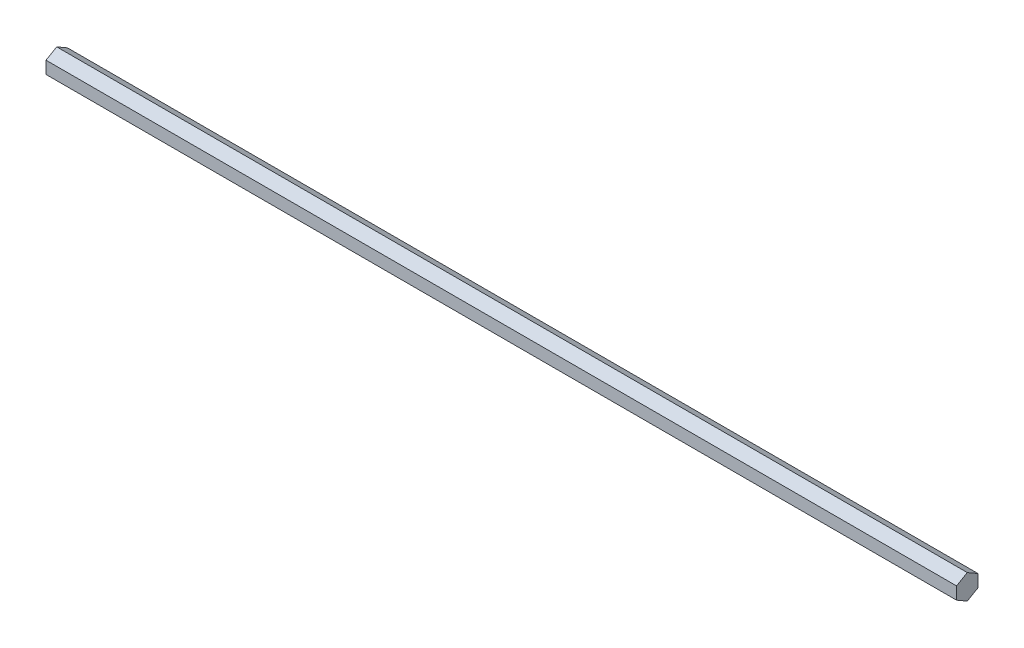
ISO-10303-21;
HEADER;
FILE_DESCRIPTION(('STEP AP214'),'2;1');
FILE_NAME('part.step','',(''),(''),'','','');
FILE_SCHEMA(('AUTOMOTIVE_DESIGN { 1 0 10303 214 1 1 1 1 }'));
ENDSEC;
DATA;
#1=APPLICATION_CONTEXT('core data for automotive mechanical design processes');
#2=APPLICATION_PROTOCOL_DEFINITION('international standard','automotive_design',2000,#1);
#3=PRODUCT_CONTEXT('',#1,'mechanical');
#4=PRODUCT('Part','Part','',(#3));
#5=PRODUCT_RELATED_PRODUCT_CATEGORY('part','',(#4));
#6=PRODUCT_DEFINITION_FORMATION('','',#4);
#7=PRODUCT_DEFINITION_CONTEXT('part definition',#1,'design');
#8=PRODUCT_DEFINITION('design','',#6,#7);
#9=PRODUCT_DEFINITION_SHAPE('','',#8);
#10=(LENGTH_UNIT() NAMED_UNIT(*) SI_UNIT(.MILLI.,.METRE.));
#11=(NAMED_UNIT(*) PLANE_ANGLE_UNIT() SI_UNIT($,.RADIAN.));
#12=(NAMED_UNIT(*) SI_UNIT($,.STERADIAN.) SOLID_ANGLE_UNIT());
#13=UNCERTAINTY_MEASURE_WITH_UNIT(LENGTH_MEASURE(1.E-05),#10,'distance_accuracy_value','');
#14=(GEOMETRIC_REPRESENTATION_CONTEXT(3) GLOBAL_UNCERTAINTY_ASSIGNED_CONTEXT((#13)) GLOBAL_UNIT_ASSIGNED_CONTEXT((#10,
#11,#12)) REPRESENTATION_CONTEXT('',''));
#15=CARTESIAN_POINT('',(0.,0.,0.));
#16=DIRECTION('',(0.,0.,1.));
#17=DIRECTION('',(1.,0.,0.));
#18=AXIS2_PLACEMENT_3D('',#15,#16,#17);
#19=CARTESIAN_POINT('',(539.75,3.6661742093542,-6.34999999999996));
#20=DIRECTION('',(0.,-0.866025403784442,0.499999999999995));
#21=DIRECTION('',(0.,-0.499999999999995,-0.866025403784442));
#22=AXIS2_PLACEMENT_3D('',#19,#20,#21);
#23=PLANE('',#22);
#24=DIRECTION('',(0.,0.499999999999995,0.866025403784442));
#25=VECTOR('',#24,1.);
#26=CARTESIAN_POINT('',(0.,3.6661742093542,-6.34999999999996));
#27=LINE('',#26,#25);
#28=CARTESIAN_POINT('',(0.,3.6661742093542,-6.34999999999996));
#29=VERTEX_POINT('',#28);
#30=CARTESIAN_POINT('',(0.,7.33234841870825,0.));
#31=VERTEX_POINT('',#30);
#32=EDGE_CURVE('E132',#29,#31,#27,.T.);
#33=ORIENTED_EDGE('',*,*,#32,.T.);
#34=DIRECTION('',(-1.,0.,0.));
#35=VECTOR('',#34,1.);
#36=CARTESIAN_POINT('',(539.75,7.33234841870825,0.));
#37=LINE('',#36,#35);
#38=CARTESIAN_POINT('',(539.75,7.33234841870825,0.));
#39=VERTEX_POINT('',#38);
#40=EDGE_CURVE('E11',#39,#31,#37,.T.);
#41=ORIENTED_EDGE('',*,*,#40,.F.);
#42=DIRECTION('',(0.,0.499999999999995,0.866025403784442));
#43=VECTOR('',#42,1.);
#44=CARTESIAN_POINT('',(539.75,3.6661742093542,-6.34999999999996));
#45=LINE('',#44,#43);
#46=CARTESIAN_POINT('',(539.75,3.6661742093542,-6.34999999999996));
#47=VERTEX_POINT('',#46);
#48=EDGE_CURVE('E142',#47,#39,#45,.T.);
#49=ORIENTED_EDGE('',*,*,#48,.F.);
#50=DIRECTION('',(-1.,0.,0.));
#51=VECTOR('',#50,1.);
#52=CARTESIAN_POINT('',(539.75,3.6661742093542,-6.34999999999996));
#53=LINE('',#52,#51);
#54=EDGE_CURVE('E128',#47,#29,#53,.T.);
#55=ORIENTED_EDGE('',*,*,#54,.T.);
#56=EDGE_LOOP('',(#33,#41,#49,#55));
#57=FACE_BOUND('',#56,.T.);
#58=ADVANCED_FACE('F37',(#57),#23,.F.);
#59=CARTESIAN_POINT('',(539.75,7.33234841870825,0.));
#60=DIRECTION('',(0.,-0.866025403784438,-0.500000000000001));
#61=DIRECTION('',(0.,0.500000000000001,-0.866025403784438));
#62=AXIS2_PLACEMENT_3D('',#59,#60,#61);
#63=PLANE('',#62);
#64=DIRECTION('',(0.,-0.500000000000001,0.866025403784438));
#65=VECTOR('',#64,1.);
#66=CARTESIAN_POINT('',(0.,7.33234841870825,0.));
#67=LINE('',#66,#65);
#68=CARTESIAN_POINT('',(0.,3.66617420935411,6.35000000000001));
#69=VERTEX_POINT('',#68);
#70=EDGE_CURVE('E135',#31,#69,#67,.T.);
#71=ORIENTED_EDGE('',*,*,#70,.T.);
#72=DIRECTION('',(-1.,0.,0.));
#73=VECTOR('',#72,1.);
#74=CARTESIAN_POINT('',(539.75,3.66617420935411,6.35000000000001));
#75=LINE('',#74,#73);
#76=CARTESIAN_POINT('',(539.75,3.66617420935411,6.35000000000001));
#77=VERTEX_POINT('',#76);
#78=EDGE_CURVE('E46',#77,#69,#75,.T.);
#79=ORIENTED_EDGE('',*,*,#78,.F.);
#80=DIRECTION('',(0.,-0.500000000000001,0.866025403784438));
#81=VECTOR('',#80,1.);
#82=CARTESIAN_POINT('',(539.75,7.33234841870825,0.));
#83=LINE('',#82,#81);
#84=EDGE_CURVE('E96',#39,#77,#83,.T.);
#85=ORIENTED_EDGE('',*,*,#84,.F.);
#86=ORIENTED_EDGE('',*,*,#40,.T.);
#87=EDGE_LOOP('',(#71,#79,#85,#86));
#88=FACE_BOUND('',#87,.T.);
#89=ADVANCED_FACE('F172',(#88),#63,.F.);
#90=CARTESIAN_POINT('',(539.75,3.66617420935411,6.35000000000001));
#91=DIRECTION('',(0.,0.,-1.));
#92=DIRECTION('',(0.,1.,0.));
#93=AXIS2_PLACEMENT_3D('',#90,#91,#92);
#94=PLANE('',#93);
#95=DIRECTION('',(0.,-1.,0.));
#96=VECTOR('',#95,1.);
#97=CARTESIAN_POINT('',(0.,3.66617420935411,6.35000000000001));
#98=LINE('',#97,#96);
#99=CARTESIAN_POINT('',(0.,-3.66617420935416,6.34999999999999));
#100=VERTEX_POINT('',#99);
#101=EDGE_CURVE('E137',#69,#100,#98,.T.);
#102=ORIENTED_EDGE('',*,*,#101,.T.);
#103=DIRECTION('',(-1.,0.,0.));
#104=VECTOR('',#103,1.);
#105=CARTESIAN_POINT('',(539.75,-3.66617420935416,6.34999999999999));
#106=LINE('',#105,#104);
#107=CARTESIAN_POINT('',(539.75,-3.66617420935416,6.34999999999999));
#108=VERTEX_POINT('',#107);
#109=EDGE_CURVE('E121',#108,#100,#106,.T.);
#110=ORIENTED_EDGE('',*,*,#109,.F.);
#111=DIRECTION('',(0.,-1.,0.));
#112=VECTOR('',#111,1.);
#113=CARTESIAN_POINT('',(539.75,3.66617420935411,6.35000000000001));
#114=LINE('',#113,#112);
#115=EDGE_CURVE('E110',#77,#108,#114,.T.);
#116=ORIENTED_EDGE('',*,*,#115,.F.);
#117=ORIENTED_EDGE('',*,*,#78,.T.);
#118=EDGE_LOOP('',(#102,#110,#116,#117));
#119=FACE_BOUND('',#118,.T.);
#120=ADVANCED_FACE('F154',(#119),#94,.F.);
#121=CARTESIAN_POINT('',(539.75,-3.66617420935416,6.34999999999999));
#122=DIRECTION('',(0.,0.866025403784442,-0.499999999999995));
#123=DIRECTION('',(0.,0.499999999999995,0.866025403784442));
#124=AXIS2_PLACEMENT_3D('',#121,#122,#123);
#125=PLANE('',#124);
#126=DIRECTION('',(0.,-0.499999999999995,-0.866025403784442));
#127=VECTOR('',#126,1.);
#128=CARTESIAN_POINT('',(0.,-3.66617420935416,6.34999999999999));
#129=LINE('',#128,#127);
#130=CARTESIAN_POINT('',(0.,-7.33234841870825,0.));
#131=VERTEX_POINT('',#130);
#132=EDGE_CURVE('E119',#100,#131,#129,.T.);
#133=ORIENTED_EDGE('',*,*,#132,.T.);
#134=DIRECTION('',(-1.,0.,0.));
#135=VECTOR('',#134,1.);
#136=CARTESIAN_POINT('',(539.75,-7.33234841870825,0.));
#137=LINE('',#136,#135);
#138=CARTESIAN_POINT('',(539.75,-7.33234841870825,0.));
#139=VERTEX_POINT('',#138);
#140=EDGE_CURVE('E116',#139,#131,#137,.T.);
#141=ORIENTED_EDGE('',*,*,#140,.F.);
#142=DIRECTION('',(0.,-0.499999999999995,-0.866025403784442));
#143=VECTOR('',#142,1.);
#144=CARTESIAN_POINT('',(539.75,-3.66617420935416,6.34999999999999));
#145=LINE('',#144,#143);
#146=EDGE_CURVE('E104',#108,#139,#145,.T.);
#147=ORIENTED_EDGE('',*,*,#146,.F.);
#148=ORIENTED_EDGE('',*,*,#109,.T.);
#149=EDGE_LOOP('',(#133,#141,#147,#148));
#150=FACE_BOUND('',#149,.T.);
#151=ADVANCED_FACE('F117',(#150),#125,.F.);
#152=CARTESIAN_POINT('',(539.75,-7.33234841870825,0.));
#153=DIRECTION('',(0.,0.866025403784435,0.500000000000007));
#154=DIRECTION('',(0.,-0.500000000000007,0.866025403784435));
#155=AXIS2_PLACEMENT_3D('',#152,#153,#154);
#156=PLANE('',#155);
#157=DIRECTION('',(0.,0.500000000000007,-0.866025403784435));
#158=VECTOR('',#157,1.);
#159=CARTESIAN_POINT('',(0.,-7.33234841870825,0.));
#160=LINE('',#159,#158);
#161=CARTESIAN_POINT('',(0.,-3.66617420935407,-6.35000000000004));
#162=VERTEX_POINT('',#161);
#163=EDGE_CURVE('E81',#131,#162,#160,.T.);
#164=ORIENTED_EDGE('',*,*,#163,.T.);
#165=DIRECTION('',(-1.,0.,0.));
#166=VECTOR('',#165,1.);
#167=CARTESIAN_POINT('',(539.75,-3.66617420935407,-6.35000000000004));
#168=LINE('',#167,#166);
#169=CARTESIAN_POINT('',(539.75,-3.66617420935407,-6.35000000000004));
#170=VERTEX_POINT('',#169);
#171=EDGE_CURVE('E122',#170,#162,#168,.T.);
#172=ORIENTED_EDGE('',*,*,#171,.F.);
#173=DIRECTION('',(0.,0.500000000000007,-0.866025403784435));
#174=VECTOR('',#173,1.);
#175=CARTESIAN_POINT('',(539.75,-7.33234841870825,0.));
#176=LINE('',#175,#174);
#177=EDGE_CURVE('E108',#139,#170,#176,.T.);
#178=ORIENTED_EDGE('',*,*,#177,.F.);
#179=ORIENTED_EDGE('',*,*,#140,.T.);
#180=EDGE_LOOP('',(#164,#172,#178,#179));
#181=FACE_BOUND('',#180,.T.);
#182=ADVANCED_FACE('F124',(#181),#156,.F.);
#183=CARTESIAN_POINT('',(539.75,-3.66617420935407,-6.35000000000004));
#184=DIRECTION('',(0.,0.,1.));
#185=DIRECTION('',(0.,-1.,0.));
#186=AXIS2_PLACEMENT_3D('',#183,#184,#185);
#187=PLANE('',#186);
#188=DIRECTION('',(0.,1.,0.));
#189=VECTOR('',#188,1.);
#190=CARTESIAN_POINT('',(0.,-3.66617420935407,-6.35000000000004));
#191=LINE('',#190,#189);
#192=EDGE_CURVE('E87',#162,#29,#191,.T.);
#193=ORIENTED_EDGE('',*,*,#192,.T.);
#194=ORIENTED_EDGE('',*,*,#54,.F.);
#195=DIRECTION('',(0.,1.,0.));
#196=VECTOR('',#195,1.);
#197=CARTESIAN_POINT('',(539.75,-3.66617420935407,-6.35000000000004));
#198=LINE('',#197,#196);
#199=EDGE_CURVE('E57',#170,#47,#198,.T.);
#200=ORIENTED_EDGE('',*,*,#199,.F.);
#201=ORIENTED_EDGE('',*,*,#171,.T.);
#202=EDGE_LOOP('',(#193,#194,#200,#201));
#203=FACE_BOUND('',#202,.T.);
#204=ADVANCED_FACE('F161',(#203),#187,.F.);
#205=CARTESIAN_POINT('',(539.75,0.,0.));
#206=DIRECTION('',(1.,0.,0.));
#207=DIRECTION('',(0.,0.,-1.));
#208=AXIS2_PLACEMENT_3D('',#205,#206,#207);
#209=PLANE('',#208);
#210=ORIENTED_EDGE('',*,*,#48,.T.);
#211=ORIENTED_EDGE('',*,*,#84,.T.);
#212=ORIENTED_EDGE('',*,*,#115,.T.);
#213=ORIENTED_EDGE('',*,*,#146,.T.);
#214=ORIENTED_EDGE('',*,*,#177,.T.);
#215=ORIENTED_EDGE('',*,*,#199,.T.);
#216=EDGE_LOOP('',(#210,#211,#212,#213,#214,#215));
#217=FACE_BOUND('',#216,.T.);
#218=ADVANCED_FACE('F106',(#217),#209,.T.);
#219=CARTESIAN_POINT('',(0.,0.,0.));
#220=DIRECTION('',(1.,0.,0.));
#221=DIRECTION('',(0.,0.,-1.));
#222=AXIS2_PLACEMENT_3D('',#219,#220,#221);
#223=PLANE('',#222);
#224=ORIENTED_EDGE('',*,*,#32,.F.);
#225=ORIENTED_EDGE('',*,*,#192,.F.);
#226=ORIENTED_EDGE('',*,*,#163,.F.);
#227=ORIENTED_EDGE('',*,*,#132,.F.);
#228=ORIENTED_EDGE('',*,*,#101,.F.);
#229=ORIENTED_EDGE('',*,*,#70,.F.);
#230=EDGE_LOOP('',(#224,#225,#226,#227,#228,#229));
#231=FACE_BOUND('',#230,.T.);
#232=ADVANCED_FACE('F157',(#231),#223,.F.);
#233=CLOSED_SHELL('',(#58,#89,#120,#151,#182,#204,#218,#232));
#234=MANIFOLD_SOLID_BREP('B2',#233);
#235=ADVANCED_BREP_SHAPE_REPRESENTATION('',(#18,#234),#14);
#236=SHAPE_DEFINITION_REPRESENTATION(#9,#235);
ENDSEC;
END-ISO-10303-21;
